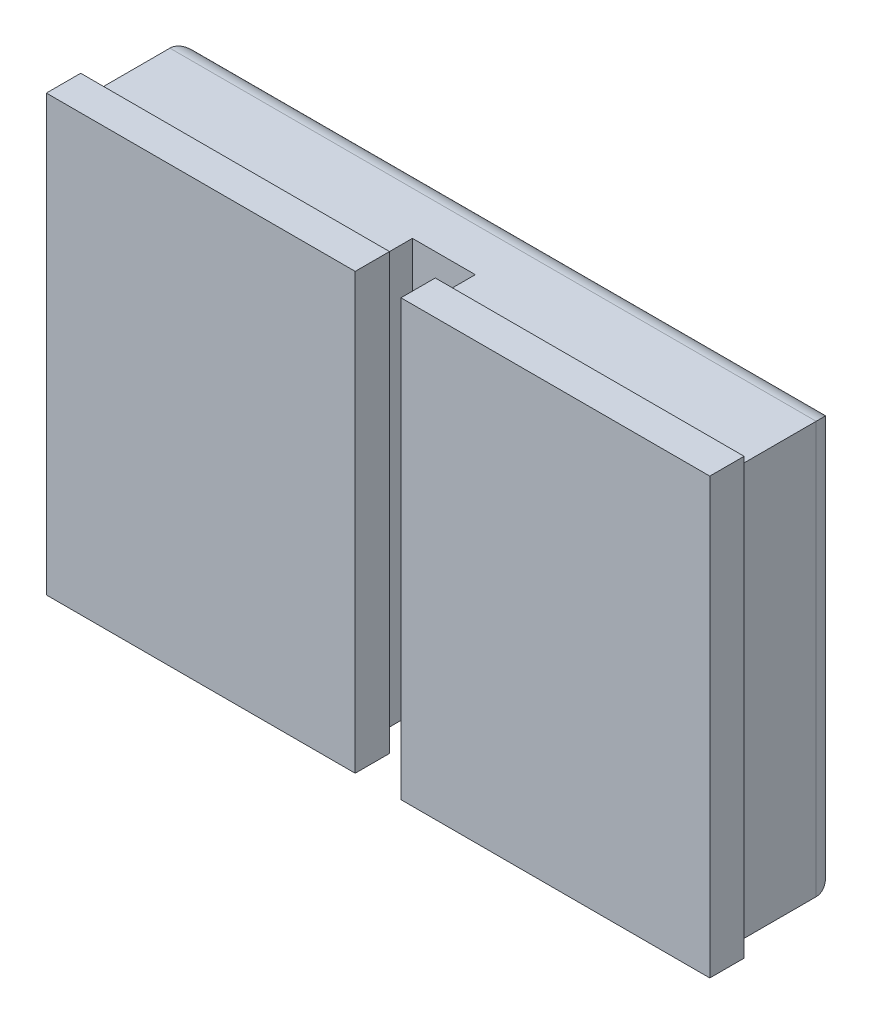
ISO-10303-21;
HEADER;
FILE_DESCRIPTION(('STEP AP214'),'2;1');
FILE_NAME('part.step','',(''),(''),'','','');
FILE_SCHEMA(('AUTOMOTIVE_DESIGN { 1 0 10303 214 1 1 1 1 }'));
ENDSEC;
DATA;
#1=APPLICATION_CONTEXT('core data for automotive mechanical design processes');
#2=APPLICATION_PROTOCOL_DEFINITION('international standard','automotive_design',2000,#1);
#3=PRODUCT_CONTEXT('',#1,'mechanical');
#4=PRODUCT('Part','Part','',(#3));
#5=PRODUCT_RELATED_PRODUCT_CATEGORY('part','',(#4));
#6=PRODUCT_DEFINITION_FORMATION('','',#4);
#7=PRODUCT_DEFINITION_CONTEXT('part definition',#1,'design');
#8=PRODUCT_DEFINITION('design','',#6,#7);
#9=PRODUCT_DEFINITION_SHAPE('','',#8);
#10=(LENGTH_UNIT() NAMED_UNIT(*) SI_UNIT(.MILLI.,.METRE.));
#11=(NAMED_UNIT(*) PLANE_ANGLE_UNIT() SI_UNIT($,.RADIAN.));
#12=(NAMED_UNIT(*) SI_UNIT($,.STERADIAN.) SOLID_ANGLE_UNIT());
#13=UNCERTAINTY_MEASURE_WITH_UNIT(LENGTH_MEASURE(1.E-05),#10,'distance_accuracy_value','');
#14=(GEOMETRIC_REPRESENTATION_CONTEXT(3) GLOBAL_UNCERTAINTY_ASSIGNED_CONTEXT((#13)) GLOBAL_UNIT_ASSIGNED_CONTEXT((#10,
#11,#12)) REPRESENTATION_CONTEXT('',''));
#15=CARTESIAN_POINT('',(0.,0.,0.));
#16=DIRECTION('',(0.,0.,1.));
#17=DIRECTION('',(1.,0.,0.));
#18=AXIS2_PLACEMENT_3D('',#15,#16,#17);
#19=CARTESIAN_POINT('',(-1.5875,2.286,0.762));
#20=DIRECTION('',(0.,-1.,0.));
#21=DIRECTION('',(0.,0.,-1.));
#22=AXIS2_PLACEMENT_3D('',#19,#20,#21);
#23=PLANE('',#22);
#24=DIRECTION('',(-1.,0.,0.));
#25=VECTOR('',#24,1.);
#26=CARTESIAN_POINT('',(-1.5875,2.286,0.381));
#27=LINE('',#26,#25);
#28=CARTESIAN_POINT('',(5.588,2.286,0.381));
#29=VERTEX_POINT('',#28);
#30=CARTESIAN_POINT('',(2.286,2.286,0.381));
#31=VERTEX_POINT('',#30);
#32=EDGE_CURVE('E50',#29,#31,#27,.T.);
#33=ORIENTED_EDGE('',*,*,#32,.F.);
#34=DIRECTION('',(0.,0.,1.));
#35=VECTOR('',#34,1.);
#36=CARTESIAN_POINT('',(5.588,2.286,-0.7366));
#37=LINE('',#36,#35);
#38=CARTESIAN_POINT('',(5.588,2.286,-0.4826));
#39=VERTEX_POINT('',#38);
#40=EDGE_CURVE('E278',#39,#29,#37,.T.);
#41=ORIENTED_EDGE('',*,*,#40,.F.);
#42=DIRECTION('',(-1.,0.,0.));
#43=VECTOR('',#42,1.);
#44=CARTESIAN_POINT('',(-1.5875,2.286,-0.4826));
#45=LINE('',#44,#43);
#46=CARTESIAN_POINT('',(-1.5875,2.286,-0.482599999999999));
#47=VERTEX_POINT('',#46);
#48=EDGE_CURVE('E363',#39,#47,#45,.T.);
#49=ORIENTED_EDGE('',*,*,#48,.T.);
#50=DIRECTION('',(0.,0.,-1.));
#51=VECTOR('',#50,1.);
#52=CARTESIAN_POINT('',(-1.5875,2.286,0.762));
#53=LINE('',#52,#51);
#54=CARTESIAN_POINT('',(-1.5875,2.286,0.381));
#55=VERTEX_POINT('',#54);
#56=EDGE_CURVE('E291',#55,#47,#53,.T.);
#57=ORIENTED_EDGE('',*,*,#56,.F.);
#58=DIRECTION('',(-1.,0.,0.));
#59=VECTOR('',#58,1.);
#60=CARTESIAN_POINT('',(-1.5875,2.286,0.381));
#61=LINE('',#60,#59);
#62=CARTESIAN_POINT('',(1.5875,2.286,0.381));
#63=VERTEX_POINT('',#62);
#64=EDGE_CURVE('E242',#63,#55,#61,.T.);
#65=ORIENTED_EDGE('',*,*,#64,.F.);
#66=DIRECTION('',(0.,0.,-1.));
#67=VECTOR('',#66,1.);
#68=CARTESIAN_POINT('',(1.5875,2.286,0.762));
#69=LINE('',#68,#67);
#70=CARTESIAN_POINT('',(1.5875,2.286,0.));
#71=VERTEX_POINT('',#70);
#72=EDGE_CURVE('E289',#63,#71,#69,.T.);
#73=ORIENTED_EDGE('',*,*,#72,.T.);
#74=DIRECTION('',(-1.,0.,0.));
#75=VECTOR('',#74,1.);
#76=CARTESIAN_POINT('',(2.286,2.286,0.));
#77=LINE('',#76,#75);
#78=CARTESIAN_POINT('',(2.286,2.286,0.));
#79=VERTEX_POINT('',#78);
#80=EDGE_CURVE('E266',#79,#71,#77,.T.);
#81=ORIENTED_EDGE('',*,*,#80,.F.);
#82=DIRECTION('',(0.,0.,-1.));
#83=VECTOR('',#82,1.);
#84=CARTESIAN_POINT('',(2.286,2.286,0.762));
#85=LINE('',#84,#83);
#86=EDGE_CURVE('E255',#31,#79,#85,.T.);
#87=ORIENTED_EDGE('',*,*,#86,.F.);
#88=EDGE_LOOP('',(#33,#41,#49,#57,#65,#73,#81,#87));
#89=FACE_BOUND('',#88,.T.);
#90=ADVANCED_FACE('F35',(#89),#23,.F.);
#91=CARTESIAN_POINT('',(-1.5875,-2.286,0.762));
#92=DIRECTION('',(0.,1.,0.));
#93=DIRECTION('',(0.,0.,1.));
#94=AXIS2_PLACEMENT_3D('',#91,#92,#93);
#95=PLANE('',#94);
#96=DIRECTION('',(1.,0.,0.));
#97=VECTOR('',#96,1.);
#98=CARTESIAN_POINT('',(-1.5875,-2.286,0.381));
#99=LINE('',#98,#97);
#100=CARTESIAN_POINT('',(2.286,-2.286,0.381));
#101=VERTEX_POINT('',#100);
#102=CARTESIAN_POINT('',(5.588,-2.286,0.381));
#103=VERTEX_POINT('',#102);
#104=EDGE_CURVE('E200',#101,#103,#99,.T.);
#105=ORIENTED_EDGE('',*,*,#104,.F.);
#106=DIRECTION('',(0.,0.,-1.));
#107=VECTOR('',#106,1.);
#108=CARTESIAN_POINT('',(2.286,-2.286,0.762));
#109=LINE('',#108,#107);
#110=CARTESIAN_POINT('',(2.286,-2.286,0.));
#111=VERTEX_POINT('',#110);
#112=EDGE_CURVE('E252',#101,#111,#109,.T.);
#113=ORIENTED_EDGE('',*,*,#112,.T.);
#114=DIRECTION('',(1.,0.,0.));
#115=VECTOR('',#114,1.);
#116=CARTESIAN_POINT('',(2.286,-2.286,0.));
#117=LINE('',#116,#115);
#118=CARTESIAN_POINT('',(1.5875,-2.286,0.));
#119=VERTEX_POINT('',#118);
#120=EDGE_CURVE('E257',#119,#111,#117,.T.);
#121=ORIENTED_EDGE('',*,*,#120,.F.);
#122=DIRECTION('',(0.,0.,-1.));
#123=VECTOR('',#122,1.);
#124=CARTESIAN_POINT('',(1.5875,-2.286,0.762));
#125=LINE('',#124,#123);
#126=CARTESIAN_POINT('',(1.5875,-2.286,0.381));
#127=VERTEX_POINT('',#126);
#128=EDGE_CURVE('E277',#127,#119,#125,.T.);
#129=ORIENTED_EDGE('',*,*,#128,.F.);
#130=DIRECTION('',(1.,0.,0.));
#131=VECTOR('',#130,1.);
#132=CARTESIAN_POINT('',(-1.5875,-2.286,0.381));
#133=LINE('',#132,#131);
#134=CARTESIAN_POINT('',(-1.5875,-2.286,0.381));
#135=VERTEX_POINT('',#134);
#136=EDGE_CURVE('E43',#135,#127,#133,.T.);
#137=ORIENTED_EDGE('',*,*,#136,.F.);
#138=DIRECTION('',(0.,0.,-1.));
#139=VECTOR('',#138,1.);
#140=CARTESIAN_POINT('',(-1.5875,-2.286,0.762));
#141=LINE('',#140,#139);
#142=CARTESIAN_POINT('',(-1.5875,-2.286,-0.482599999999999));
#143=VERTEX_POINT('',#142);
#144=EDGE_CURVE('E270',#135,#143,#141,.T.);
#145=ORIENTED_EDGE('',*,*,#144,.T.);
#146=DIRECTION('',(1.,0.,0.));
#147=VECTOR('',#146,1.);
#148=CARTESIAN_POINT('',(-1.5875,-2.286,-0.4826));
#149=LINE('',#148,#147);
#150=CARTESIAN_POINT('',(5.588,-2.286,-0.4826));
#151=VERTEX_POINT('',#150);
#152=EDGE_CURVE('E288',#143,#151,#149,.T.);
#153=ORIENTED_EDGE('',*,*,#152,.T.);
#154=DIRECTION('',(0.,0.,1.));
#155=VECTOR('',#154,1.);
#156=CARTESIAN_POINT('',(5.588,-2.286,-0.7366));
#157=LINE('',#156,#155);
#158=EDGE_CURVE('E267',#151,#103,#157,.T.);
#159=ORIENTED_EDGE('',*,*,#158,.T.);
#160=EDGE_LOOP('',(#105,#113,#121,#129,#137,#145,#153,#159));
#161=FACE_BOUND('',#160,.T.);
#162=ADVANCED_FACE('F304',(#161),#95,.F.);
#163=CARTESIAN_POINT('',(5.588,-2.286,-0.7366));
#164=DIRECTION('',(1.,0.,0.));
#165=DIRECTION('',(0.,0.,-1.));
#166=AXIS2_PLACEMENT_3D('',#163,#164,#165);
#167=PLANE('',#166);
#168=ORIENTED_EDGE('',*,*,#40,.T.);
#169=DIRECTION('',(0.,-1.,0.));
#170=VECTOR('',#169,1.);
#171=CARTESIAN_POINT('',(5.588,-2.286,0.381));
#172=LINE('',#171,#170);
#173=EDGE_CURVE('E57',#29,#103,#172,.T.);
#174=ORIENTED_EDGE('',*,*,#173,.T.);
#175=ORIENTED_EDGE('',*,*,#158,.F.);
#176=DIRECTION('',(0.,1.,0.));
#177=VECTOR('',#176,1.);
#178=CARTESIAN_POINT('',(5.588,2.286,-0.4826));
#179=LINE('',#178,#177);
#180=EDGE_CURVE('E321',#151,#39,#179,.T.);
#181=ORIENTED_EDGE('',*,*,#180,.T.);
#182=EDGE_LOOP('',(#168,#174,#175,#181));
#183=FACE_BOUND('',#182,.T.);
#184=ADVANCED_FACE('F344',(#183),#167,.T.);
#185=CARTESIAN_POINT('',(2.286,-2.286,0.762));
#186=DIRECTION('',(1.,0.,0.));
#187=DIRECTION('',(0.,0.,-1.));
#188=AXIS2_PLACEMENT_3D('',#185,#186,#187);
#189=PLANE('',#188);
#190=DIRECTION('',(0.,-1.,0.));
#191=VECTOR('',#190,1.);
#192=CARTESIAN_POINT('',(2.286,-2.286,0.381));
#193=LINE('',#192,#191);
#194=EDGE_CURVE('E11',#31,#101,#193,.T.);
#195=ORIENTED_EDGE('',*,*,#194,.F.);
#196=ORIENTED_EDGE('',*,*,#86,.T.);
#197=DIRECTION('',(0.,-1.,0.));
#198=VECTOR('',#197,1.);
#199=CARTESIAN_POINT('',(2.286,-2.286,0.));
#200=LINE('',#199,#198);
#201=EDGE_CURVE('E249',#79,#111,#200,.T.);
#202=ORIENTED_EDGE('',*,*,#201,.T.);
#203=ORIENTED_EDGE('',*,*,#112,.F.);
#204=EDGE_LOOP('',(#195,#196,#202,#203));
#205=FACE_BOUND('',#204,.T.);
#206=ADVANCED_FACE('F335',(#205),#189,.F.);
#207=CARTESIAN_POINT('',(1.5875,-2.286,0.762));
#208=DIRECTION('',(-1.,0.,0.));
#209=DIRECTION('',(0.,0.,1.));
#210=AXIS2_PLACEMENT_3D('',#207,#208,#209);
#211=PLANE('',#210);
#212=DIRECTION('',(0.,1.,0.));
#213=VECTOR('',#212,1.);
#214=CARTESIAN_POINT('',(1.5875,-2.286,0.381));
#215=LINE('',#214,#213);
#216=EDGE_CURVE('E245',#127,#63,#215,.T.);
#217=ORIENTED_EDGE('',*,*,#216,.F.);
#218=ORIENTED_EDGE('',*,*,#128,.T.);
#219=DIRECTION('',(0.,1.,0.));
#220=VECTOR('',#219,1.);
#221=CARTESIAN_POINT('',(1.5875,-2.286,0.));
#222=LINE('',#221,#220);
#223=EDGE_CURVE('E273',#119,#71,#222,.T.);
#224=ORIENTED_EDGE('',*,*,#223,.T.);
#225=ORIENTED_EDGE('',*,*,#72,.F.);
#226=EDGE_LOOP('',(#217,#218,#224,#225));
#227=FACE_BOUND('',#226,.T.);
#228=ADVANCED_FACE('F326',(#227),#211,.F.);
#229=CARTESIAN_POINT('',(-1.5875,-2.286,0.762));
#230=DIRECTION('',(1.,0.,0.));
#231=DIRECTION('',(0.,0.,-1.));
#232=AXIS2_PLACEMENT_3D('',#229,#230,#231);
#233=PLANE('',#232);
#234=DIRECTION('',(0.,-1.,0.));
#235=VECTOR('',#234,1.);
#236=CARTESIAN_POINT('',(-1.5875,-2.286,0.381));
#237=LINE('',#236,#235);
#238=EDGE_CURVE('E233',#55,#135,#237,.T.);
#239=ORIENTED_EDGE('',*,*,#238,.F.);
#240=ORIENTED_EDGE('',*,*,#56,.T.);
#241=DIRECTION('',(0.,-1.,0.));
#242=VECTOR('',#241,1.);
#243=CARTESIAN_POINT('',(-1.5875,-2.286,-0.4826));
#244=LINE('',#243,#242);
#245=EDGE_CURVE('E290',#47,#143,#244,.T.);
#246=ORIENTED_EDGE('',*,*,#245,.T.);
#247=ORIENTED_EDGE('',*,*,#144,.F.);
#248=EDGE_LOOP('',(#239,#240,#246,#247));
#249=FACE_BOUND('',#248,.T.);
#250=ADVANCED_FACE('F323',(#249),#233,.F.);
#251=CARTESIAN_POINT('',(0.,0.,0.));
#252=DIRECTION('',(0.,0.,1.));
#253=DIRECTION('',(1.,0.,0.));
#254=AXIS2_PLACEMENT_3D('',#251,#252,#253);
#255=PLANE('',#254);
#256=ORIENTED_EDGE('',*,*,#120,.T.);
#257=ORIENTED_EDGE('',*,*,#201,.F.);
#258=ORIENTED_EDGE('',*,*,#80,.T.);
#259=ORIENTED_EDGE('',*,*,#223,.F.);
#260=EDGE_LOOP('',(#256,#257,#258,#259));
#261=FACE_BOUND('',#260,.T.);
#262=ADVANCED_FACE('F325',(#261),#255,.T.);
#263=CARTESIAN_POINT('',(0.,0.,-0.7366));
#264=DIRECTION('',(0.,0.,1.));
#265=DIRECTION('',(1.,0.,0.));
#266=AXIS2_PLACEMENT_3D('',#263,#264,#265);
#267=PLANE('',#266);
#268=DIRECTION('',(1.,0.,0.));
#269=VECTOR('',#268,1.);
#270=CARTESIAN_POINT('',(0.,-2.032,-0.7366));
#271=LINE('',#270,#269);
#272=CARTESIAN_POINT('',(5.334,-2.032,-0.7366));
#273=VERTEX_POINT('',#272);
#274=CARTESIAN_POINT('',(-1.3335,-2.032,-0.7366));
#275=VERTEX_POINT('',#274);
#276=EDGE_CURVE('E296',#273,#275,#271,.F.);
#277=ORIENTED_EDGE('',*,*,#276,.T.);
#278=DIRECTION('',(0.,-1.,0.));
#279=VECTOR('',#278,1.);
#280=CARTESIAN_POINT('',(-1.3335,0.,-0.7366));
#281=LINE('',#280,#279);
#282=CARTESIAN_POINT('',(-1.3335,2.032,-0.7366));
#283=VERTEX_POINT('',#282);
#284=EDGE_CURVE('E312',#275,#283,#281,.F.);
#285=ORIENTED_EDGE('',*,*,#284,.T.);
#286=DIRECTION('',(-1.,0.,0.));
#287=VECTOR('',#286,1.);
#288=CARTESIAN_POINT('',(0.,2.032,-0.7366));
#289=LINE('',#288,#287);
#290=CARTESIAN_POINT('',(5.334,2.032,-0.7366));
#291=VERTEX_POINT('',#290);
#292=EDGE_CURVE('E362',#283,#291,#289,.F.);
#293=ORIENTED_EDGE('',*,*,#292,.T.);
#294=DIRECTION('',(0.,1.,0.));
#295=VECTOR('',#294,1.);
#296=CARTESIAN_POINT('',(5.334,-2.286,-0.7366));
#297=LINE('',#296,#295);
#298=EDGE_CURVE('E372',#291,#273,#297,.F.);
#299=ORIENTED_EDGE('',*,*,#298,.T.);
#300=EDGE_LOOP('',(#277,#285,#293,#299));
#301=FACE_BOUND('',#300,.T.);
#302=ADVANCED_FACE('F332',(#301),#267,.F.);
#303=CARTESIAN_POINT('',(5.334,-2.286,-0.4826));
#304=DIRECTION('',(0.,-1.,0.));
#305=DIRECTION('',(0.,0.,-1.));
#306=AXIS2_PLACEMENT_3D('',#303,#304,#305);
#307=CYLINDRICAL_SURFACE('',#306,0.254);
#308=CARTESIAN_POINT('',(5.334,-2.032,-0.4826));
#309=DIRECTION('',(0.707106781186547,0.707106781186547,0.));
#310=DIRECTION('',(0.707106781186547,-0.707106781186547,0.));
#311=AXIS2_PLACEMENT_3D('',#308,#309,#310);
#312=ELLIPSE('',#311,0.359210244842766,0.254);
#313=EDGE_CURVE('E320',#273,#151,#312,.F.);
#314=ORIENTED_EDGE('',*,*,#313,.F.);
#315=ORIENTED_EDGE('',*,*,#298,.F.);
#316=CARTESIAN_POINT('',(5.334,2.032,-0.4826));
#317=DIRECTION('',(0.707106781186547,-0.707106781186547,0.));
#318=DIRECTION('',(-0.707106781186547,-0.707106781186547,0.));
#319=AXIS2_PLACEMENT_3D('',#316,#317,#318);
#320=ELLIPSE('',#319,0.359210244842766,0.254);
#321=EDGE_CURVE('E253',#39,#291,#320,.F.);
#322=ORIENTED_EDGE('',*,*,#321,.F.);
#323=ORIENTED_EDGE('',*,*,#180,.F.);
#324=EDGE_LOOP('',(#314,#315,#322,#323));
#325=FACE_BOUND('',#324,.T.);
#326=ADVANCED_FACE('F37',(#325),#307,.T.);
#327=CARTESIAN_POINT('',(-1.5875,2.032,-0.4826));
#328=DIRECTION('',(-1.,0.,0.));
#329=DIRECTION('',(0.,0.,1.));
#330=AXIS2_PLACEMENT_3D('',#327,#328,#329);
#331=CYLINDRICAL_SURFACE('',#330,0.254);
#332=ORIENTED_EDGE('',*,*,#321,.T.);
#333=ORIENTED_EDGE('',*,*,#292,.F.);
#334=CARTESIAN_POINT('',(-1.3335,2.032,-0.4826));
#335=DIRECTION('',(-0.707106781186547,-0.707106781186547,0.));
#336=DIRECTION('',(-0.707106781186547,0.707106781186547,0.));
#337=AXIS2_PLACEMENT_3D('',#334,#335,#336);
#338=ELLIPSE('',#337,0.359210244842766,0.254);
#339=EDGE_CURVE('E315',#47,#283,#338,.T.);
#340=ORIENTED_EDGE('',*,*,#339,.F.);
#341=ORIENTED_EDGE('',*,*,#48,.F.);
#342=EDGE_LOOP('',(#332,#333,#340,#341));
#343=FACE_BOUND('',#342,.T.);
#344=ADVANCED_FACE('F350',(#343),#331,.T.);
#345=CARTESIAN_POINT('',(-1.5875,-2.032,-0.4826));
#346=DIRECTION('',(1.,0.,0.));
#347=DIRECTION('',(0.,0.,-1.));
#348=AXIS2_PLACEMENT_3D('',#345,#346,#347);
#349=CYLINDRICAL_SURFACE('',#348,0.254);
#350=ORIENTED_EDGE('',*,*,#313,.T.);
#351=ORIENTED_EDGE('',*,*,#152,.F.);
#352=CARTESIAN_POINT('',(-1.3335,-2.032,-0.4826));
#353=DIRECTION('',(0.707106781186547,-0.707106781186547,0.));
#354=DIRECTION('',(0.707106781186547,0.707106781186547,0.));
#355=AXIS2_PLACEMENT_3D('',#352,#353,#354);
#356=ELLIPSE('',#355,0.359210244842766,0.254);
#357=EDGE_CURVE('E248',#275,#143,#356,.F.);
#358=ORIENTED_EDGE('',*,*,#357,.F.);
#359=ORIENTED_EDGE('',*,*,#276,.F.);
#360=EDGE_LOOP('',(#350,#351,#358,#359));
#361=FACE_BOUND('',#360,.T.);
#362=ADVANCED_FACE('F318',(#361),#349,.T.);
#363=CARTESIAN_POINT('',(-1.3335,-2.286,-0.4826));
#364=DIRECTION('',(0.,-1.,0.));
#365=DIRECTION('',(0.,0.,-1.));
#366=AXIS2_PLACEMENT_3D('',#363,#364,#365);
#367=CYLINDRICAL_SURFACE('',#366,0.254);
#368=ORIENTED_EDGE('',*,*,#339,.T.);
#369=ORIENTED_EDGE('',*,*,#284,.F.);
#370=ORIENTED_EDGE('',*,*,#357,.T.);
#371=ORIENTED_EDGE('',*,*,#245,.F.);
#372=EDGE_LOOP('',(#368,#369,#370,#371));
#373=FACE_BOUND('',#372,.T.);
#374=ADVANCED_FACE('F310',(#373),#367,.T.);
#375=CARTESIAN_POINT('',(0.,0.,0.381));
#376=DIRECTION('',(0.,0.,1.));
#377=DIRECTION('',(1.,0.,0.));
#378=AXIS2_PLACEMENT_3D('',#375,#376,#377);
#379=PLANE('',#378);
#380=DIRECTION('',(1.,0.,0.));
#381=VECTOR('',#380,1.);
#382=CARTESIAN_POINT('',(0.,-2.413,0.381));
#383=LINE('',#382,#381);
#384=CARTESIAN_POINT('',(-1.7145,-2.413,0.381));
#385=VERTEX_POINT('',#384);
#386=CARTESIAN_POINT('',(1.7145,-2.413,0.381));
#387=VERTEX_POINT('',#386);
#388=EDGE_CURVE('E210',#385,#387,#383,.T.);
#389=ORIENTED_EDGE('',*,*,#388,.F.);
#390=DIRECTION('',(0.,1.,0.));
#391=VECTOR('',#390,1.);
#392=CARTESIAN_POINT('',(-1.7145,0.,0.381));
#393=LINE('',#392,#391);
#394=CARTESIAN_POINT('',(-1.7145,2.413,0.381));
#395=VERTEX_POINT('',#394);
#396=EDGE_CURVE('E219',#385,#395,#393,.T.);
#397=ORIENTED_EDGE('',*,*,#396,.T.);
#398=DIRECTION('',(1.,0.,0.));
#399=VECTOR('',#398,1.);
#400=CARTESIAN_POINT('',(0.,2.413,0.381));
#401=LINE('',#400,#399);
#402=CARTESIAN_POINT('',(1.7145,2.413,0.381));
#403=VERTEX_POINT('',#402);
#404=EDGE_CURVE('E217',#395,#403,#401,.T.);
#405=ORIENTED_EDGE('',*,*,#404,.T.);
#406=DIRECTION('',(0.,1.,0.));
#407=VECTOR('',#406,1.);
#408=CARTESIAN_POINT('',(1.7145,0.,0.381));
#409=LINE('',#408,#407);
#410=EDGE_CURVE('E213',#387,#403,#409,.T.);
#411=ORIENTED_EDGE('',*,*,#410,.F.);
#412=EDGE_LOOP('',(#389,#397,#405,#411));
#413=FACE_BOUND('',#412,.T.);
#414=ORIENTED_EDGE('',*,*,#136,.T.);
#415=ORIENTED_EDGE('',*,*,#216,.T.);
#416=ORIENTED_EDGE('',*,*,#64,.T.);
#417=ORIENTED_EDGE('',*,*,#238,.T.);
#418=EDGE_LOOP('',(#414,#415,#416,#417));
#419=FACE_BOUND('',#418,.T.);
#420=ADVANCED_FACE('F348',(#413,#419),#379,.F.);
#421=CARTESIAN_POINT('',(0.,-2.413,0.381));
#422=DIRECTION('',(0.,-1.,0.));
#423=DIRECTION('',(0.,0.,-1.));
#424=AXIS2_PLACEMENT_3D('',#421,#422,#423);
#425=PLANE('',#424);
#426=DIRECTION('',(1.,0.,0.));
#427=VECTOR('',#426,1.);
#428=CARTESIAN_POINT('',(0.,-2.413,0.762));
#429=LINE('',#428,#427);
#430=CARTESIAN_POINT('',(-1.7145,-2.413,0.762));
#431=VERTEX_POINT('',#430);
#432=CARTESIAN_POINT('',(1.7145,-2.413,0.762));
#433=VERTEX_POINT('',#432);
#434=EDGE_CURVE('E209',#431,#433,#429,.T.);
#435=ORIENTED_EDGE('',*,*,#434,.F.);
#436=DIRECTION('',(0.,0.,1.));
#437=VECTOR('',#436,1.);
#438=CARTESIAN_POINT('',(-1.7145,-2.413,0.381));
#439=LINE('',#438,#437);
#440=EDGE_CURVE('E231',#385,#431,#439,.T.);
#441=ORIENTED_EDGE('',*,*,#440,.F.);
#442=ORIENTED_EDGE('',*,*,#388,.T.);
#443=DIRECTION('',(0.,0.,1.));
#444=VECTOR('',#443,1.);
#445=CARTESIAN_POINT('',(1.7145,-2.413,0.381));
#446=LINE('',#445,#444);
#447=EDGE_CURVE('E221',#387,#433,#446,.T.);
#448=ORIENTED_EDGE('',*,*,#447,.T.);
#449=EDGE_LOOP('',(#435,#441,#442,#448));
#450=FACE_BOUND('',#449,.T.);
#451=ADVANCED_FACE('F405',(#450),#425,.T.);
#452=CARTESIAN_POINT('',(-1.7145,0.,0.381));
#453=DIRECTION('',(1.,0.,0.));
#454=DIRECTION('',(0.,0.,-1.));
#455=AXIS2_PLACEMENT_3D('',#452,#453,#454);
#456=PLANE('',#455);
#457=DIRECTION('',(0.,1.,0.));
#458=VECTOR('',#457,1.);
#459=CARTESIAN_POINT('',(-1.7145,0.,0.762));
#460=LINE('',#459,#458);
#461=CARTESIAN_POINT('',(-1.7145,2.413,0.762));
#462=VERTEX_POINT('',#461);
#463=EDGE_CURVE('E214',#431,#462,#460,.T.);
#464=ORIENTED_EDGE('',*,*,#463,.T.);
#465=DIRECTION('',(0.,0.,1.));
#466=VECTOR('',#465,1.);
#467=CARTESIAN_POINT('',(-1.7145,2.413,0.381));
#468=LINE('',#467,#466);
#469=EDGE_CURVE('E234',#395,#462,#468,.T.);
#470=ORIENTED_EDGE('',*,*,#469,.F.);
#471=ORIENTED_EDGE('',*,*,#396,.F.);
#472=ORIENTED_EDGE('',*,*,#440,.T.);
#473=EDGE_LOOP('',(#464,#470,#471,#472));
#474=FACE_BOUND('',#473,.T.);
#475=ADVANCED_FACE('F407',(#474),#456,.F.);
#476=CARTESIAN_POINT('',(0.,2.413,0.381));
#477=DIRECTION('',(0.,-1.,0.));
#478=DIRECTION('',(0.,0.,-1.));
#479=AXIS2_PLACEMENT_3D('',#476,#477,#478);
#480=PLANE('',#479);
#481=DIRECTION('',(1.,0.,0.));
#482=VECTOR('',#481,1.);
#483=CARTESIAN_POINT('',(0.,2.413,0.762));
#484=LINE('',#483,#482);
#485=CARTESIAN_POINT('',(1.7145,2.413,0.762));
#486=VERTEX_POINT('',#485);
#487=EDGE_CURVE('E227',#462,#486,#484,.T.);
#488=ORIENTED_EDGE('',*,*,#487,.T.);
#489=DIRECTION('',(0.,0.,1.));
#490=VECTOR('',#489,1.);
#491=CARTESIAN_POINT('',(1.7145,2.413,0.381));
#492=LINE('',#491,#490);
#493=EDGE_CURVE('E237',#403,#486,#492,.T.);
#494=ORIENTED_EDGE('',*,*,#493,.F.);
#495=ORIENTED_EDGE('',*,*,#404,.F.);
#496=ORIENTED_EDGE('',*,*,#469,.T.);
#497=EDGE_LOOP('',(#488,#494,#495,#496));
#498=FACE_BOUND('',#497,.T.);
#499=ADVANCED_FACE('F410',(#498),#480,.F.);
#500=CARTESIAN_POINT('',(1.7145,0.,0.381));
#501=DIRECTION('',(1.,0.,0.));
#502=DIRECTION('',(0.,0.,-1.));
#503=AXIS2_PLACEMENT_3D('',#500,#501,#502);
#504=PLANE('',#503);
#505=DIRECTION('',(0.,1.,0.));
#506=VECTOR('',#505,1.);
#507=CARTESIAN_POINT('',(1.7145,0.,0.762));
#508=LINE('',#507,#506);
#509=EDGE_CURVE('E224',#433,#486,#508,.T.);
#510=ORIENTED_EDGE('',*,*,#509,.F.);
#511=ORIENTED_EDGE('',*,*,#447,.F.);
#512=ORIENTED_EDGE('',*,*,#410,.T.);
#513=ORIENTED_EDGE('',*,*,#493,.T.);
#514=EDGE_LOOP('',(#510,#511,#512,#513));
#515=FACE_BOUND('',#514,.T.);
#516=ADVANCED_FACE('F414',(#515),#504,.T.);
#517=CARTESIAN_POINT('',(0.,0.,0.762));
#518=DIRECTION('',(0.,0.,-1.));
#519=DIRECTION('',(-1.,0.,0.));
#520=AXIS2_PLACEMENT_3D('',#517,#518,#519);
#521=PLANE('',#520);
#522=ORIENTED_EDGE('',*,*,#434,.T.);
#523=ORIENTED_EDGE('',*,*,#509,.T.);
#524=ORIENTED_EDGE('',*,*,#487,.F.);
#525=ORIENTED_EDGE('',*,*,#463,.F.);
#526=EDGE_LOOP('',(#522,#523,#524,#525));
#527=FACE_BOUND('',#526,.T.);
#528=ADVANCED_FACE('F402',(#527),#521,.F.);
#529=CARTESIAN_POINT('',(0.,-2.413,0.381));
#530=DIRECTION('',(0.,-1.,0.));
#531=DIRECTION('',(0.,0.,-1.));
#532=AXIS2_PLACEMENT_3D('',#529,#530,#531);
#533=PLANE('',#532);
#534=DIRECTION('',(1.,0.,0.));
#535=VECTOR('',#534,1.);
#536=CARTESIAN_POINT('',(0.,-2.413,0.762));
#537=LINE('',#536,#535);
#538=CARTESIAN_POINT('',(2.2225,-2.413,0.762));
#539=VERTEX_POINT('',#538);
#540=CARTESIAN_POINT('',(5.6515,-2.413,0.762));
#541=VERTEX_POINT('',#540);
#542=EDGE_CURVE('E194',#539,#541,#537,.T.);
#543=ORIENTED_EDGE('',*,*,#542,.F.);
#544=DIRECTION('',(0.,0.,1.));
#545=VECTOR('',#544,1.);
#546=CARTESIAN_POINT('',(2.2225,-2.413,0.381));
#547=LINE('',#546,#545);
#548=CARTESIAN_POINT('',(2.2225,-2.413,0.381));
#549=VERTEX_POINT('',#548);
#550=EDGE_CURVE('E185',#549,#539,#547,.T.);
#551=ORIENTED_EDGE('',*,*,#550,.F.);
#552=DIRECTION('',(1.,0.,0.));
#553=VECTOR('',#552,1.);
#554=CARTESIAN_POINT('',(0.,-2.413,0.381));
#555=LINE('',#554,#553);
#556=CARTESIAN_POINT('',(5.6515,-2.413,0.381));
#557=VERTEX_POINT('',#556);
#558=EDGE_CURVE('E179',#549,#557,#555,.T.);
#559=ORIENTED_EDGE('',*,*,#558,.T.);
#560=DIRECTION('',(0.,0.,1.));
#561=VECTOR('',#560,1.);
#562=CARTESIAN_POINT('',(5.6515,-2.413,0.381));
#563=LINE('',#562,#561);
#564=EDGE_CURVE('E163',#557,#541,#563,.T.);
#565=ORIENTED_EDGE('',*,*,#564,.T.);
#566=EDGE_LOOP('',(#543,#551,#559,#565));
#567=FACE_BOUND('',#566,.T.);
#568=ADVANCED_FACE('F184',(#567),#533,.T.);
#569=CARTESIAN_POINT('',(2.2225,0.,0.381));
#570=DIRECTION('',(1.,0.,0.));
#571=DIRECTION('',(0.,0.,-1.));
#572=AXIS2_PLACEMENT_3D('',#569,#570,#571);
#573=PLANE('',#572);
#574=DIRECTION('',(0.,1.,0.));
#575=VECTOR('',#574,1.);
#576=CARTESIAN_POINT('',(2.2225,0.,0.762));
#577=LINE('',#576,#575);
#578=CARTESIAN_POINT('',(2.2225,2.413,0.762));
#579=VERTEX_POINT('',#578);
#580=EDGE_CURVE('E187',#539,#579,#577,.T.);
#581=ORIENTED_EDGE('',*,*,#580,.T.);
#582=DIRECTION('',(0.,0.,1.));
#583=VECTOR('',#582,1.);
#584=CARTESIAN_POINT('',(2.2225,2.413,0.381));
#585=LINE('',#584,#583);
#586=CARTESIAN_POINT('',(2.2225,2.413,0.381));
#587=VERTEX_POINT('',#586);
#588=EDGE_CURVE('E201',#587,#579,#585,.T.);
#589=ORIENTED_EDGE('',*,*,#588,.F.);
#590=DIRECTION('',(0.,1.,0.));
#591=VECTOR('',#590,1.);
#592=CARTESIAN_POINT('',(2.2225,0.,0.381));
#593=LINE('',#592,#591);
#594=EDGE_CURVE('E174',#549,#587,#593,.T.);
#595=ORIENTED_EDGE('',*,*,#594,.F.);
#596=ORIENTED_EDGE('',*,*,#550,.T.);
#597=EDGE_LOOP('',(#581,#589,#595,#596));
#598=FACE_BOUND('',#597,.T.);
#599=ADVANCED_FACE('F393',(#598),#573,.F.);
#600=CARTESIAN_POINT('',(0.,2.413,0.381));
#601=DIRECTION('',(0.,-1.,0.));
#602=DIRECTION('',(0.,0.,-1.));
#603=AXIS2_PLACEMENT_3D('',#600,#601,#602);
#604=PLANE('',#603);
#605=DIRECTION('',(1.,0.,0.));
#606=VECTOR('',#605,1.);
#607=CARTESIAN_POINT('',(0.,2.413,0.762));
#608=LINE('',#607,#606);
#609=CARTESIAN_POINT('',(5.6515,2.413,0.762));
#610=VERTEX_POINT('',#609);
#611=EDGE_CURVE('E189',#579,#610,#608,.T.);
#612=ORIENTED_EDGE('',*,*,#611,.T.);
#613=DIRECTION('',(0.,0.,1.));
#614=VECTOR('',#613,1.);
#615=CARTESIAN_POINT('',(5.6515,2.413,0.381));
#616=LINE('',#615,#614);
#617=CARTESIAN_POINT('',(5.6515,2.413,0.381));
#618=VERTEX_POINT('',#617);
#619=EDGE_CURVE('E173',#618,#610,#616,.T.);
#620=ORIENTED_EDGE('',*,*,#619,.F.);
#621=DIRECTION('',(1.,0.,0.));
#622=VECTOR('',#621,1.);
#623=CARTESIAN_POINT('',(0.,2.413,0.381));
#624=LINE('',#623,#622);
#625=EDGE_CURVE('E181',#587,#618,#624,.T.);
#626=ORIENTED_EDGE('',*,*,#625,.F.);
#627=ORIENTED_EDGE('',*,*,#588,.T.);
#628=EDGE_LOOP('',(#612,#620,#626,#627));
#629=FACE_BOUND('',#628,.T.);
#630=ADVANCED_FACE('F390',(#629),#604,.F.);
#631=CARTESIAN_POINT('',(5.6515,0.,0.381));
#632=DIRECTION('',(1.,0.,0.));
#633=DIRECTION('',(0.,0.,-1.));
#634=AXIS2_PLACEMENT_3D('',#631,#632,#633);
#635=PLANE('',#634);
#636=DIRECTION('',(0.,1.,0.));
#637=VECTOR('',#636,1.);
#638=CARTESIAN_POINT('',(5.6515,0.,0.762));
#639=LINE('',#638,#637);
#640=EDGE_CURVE('E168',#541,#610,#639,.T.);
#641=ORIENTED_EDGE('',*,*,#640,.F.);
#642=ORIENTED_EDGE('',*,*,#564,.F.);
#643=DIRECTION('',(0.,1.,0.));
#644=VECTOR('',#643,1.);
#645=CARTESIAN_POINT('',(5.6515,0.,0.381));
#646=LINE('',#645,#644);
#647=EDGE_CURVE('E166',#557,#618,#646,.T.);
#648=ORIENTED_EDGE('',*,*,#647,.T.);
#649=ORIENTED_EDGE('',*,*,#619,.T.);
#650=EDGE_LOOP('',(#641,#642,#648,#649));
#651=FACE_BOUND('',#650,.T.);
#652=ADVANCED_FACE('F165',(#651),#635,.T.);
#653=CARTESIAN_POINT('',(0.,0.,0.381));
#654=DIRECTION('',(0.,0.,1.));
#655=DIRECTION('',(1.,0.,0.));
#656=AXIS2_PLACEMENT_3D('',#653,#654,#655);
#657=PLANE('',#656);
#658=ORIENTED_EDGE('',*,*,#173,.F.);
#659=ORIENTED_EDGE('',*,*,#32,.T.);
#660=ORIENTED_EDGE('',*,*,#194,.T.);
#661=ORIENTED_EDGE('',*,*,#104,.T.);
#662=EDGE_LOOP('',(#658,#659,#660,#661));
#663=FACE_BOUND('',#662,.T.);
#664=ORIENTED_EDGE('',*,*,#558,.F.);
#665=ORIENTED_EDGE('',*,*,#594,.T.);
#666=ORIENTED_EDGE('',*,*,#625,.T.);
#667=ORIENTED_EDGE('',*,*,#647,.F.);
#668=EDGE_LOOP('',(#664,#665,#666,#667));
#669=FACE_BOUND('',#668,.T.);
#670=ADVANCED_FACE('F178',(#663,#669),#657,.F.);
#671=CARTESIAN_POINT('',(0.,0.,0.762));
#672=DIRECTION('',(0.,0.,-1.));
#673=DIRECTION('',(-1.,0.,0.));
#674=AXIS2_PLACEMENT_3D('',#671,#672,#673);
#675=PLANE('',#674);
#676=ORIENTED_EDGE('',*,*,#542,.T.);
#677=ORIENTED_EDGE('',*,*,#640,.T.);
#678=ORIENTED_EDGE('',*,*,#611,.F.);
#679=ORIENTED_EDGE('',*,*,#580,.F.);
#680=EDGE_LOOP('',(#676,#677,#678,#679));
#681=FACE_BOUND('',#680,.T.);
#682=ADVANCED_FACE('F382',(#681),#675,.F.);
#683=CLOSED_SHELL('',(#90,#162,#184,#206,#228,#250,#262,#302,#326,#344,#362,#374,#420,#451,#475,
#499,#516,#528,#568,#599,#630,#652,#670,#682));
#684=MANIFOLD_SOLID_BREP('B2',#683);
#685=ADVANCED_BREP_SHAPE_REPRESENTATION('',(#18,#684),#14);
#686=SHAPE_DEFINITION_REPRESENTATION(#9,#685);
ENDSEC;
END-ISO-10303-21;
